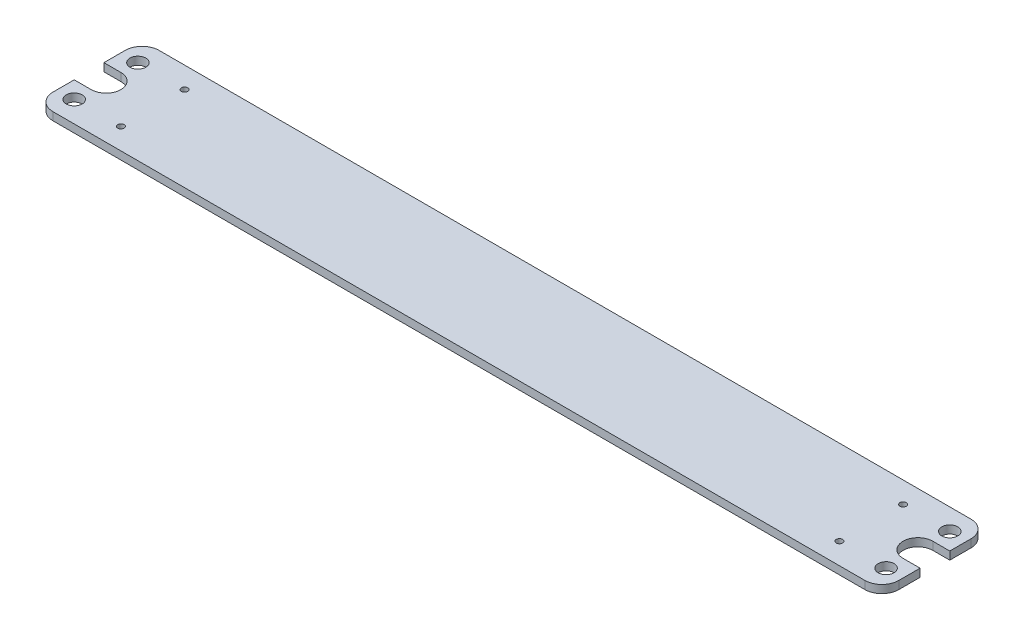
ISO-10303-21;
HEADER;
FILE_DESCRIPTION(('STEP AP214'),'2;1');
FILE_NAME('part.step','',(''),(''),'','','');
FILE_SCHEMA(('AUTOMOTIVE_DESIGN { 1 0 10303 214 1 1 1 1 }'));
ENDSEC;
DATA;
#1=APPLICATION_CONTEXT('core data for automotive mechanical design processes');
#2=APPLICATION_PROTOCOL_DEFINITION('international standard','automotive_design',2000,#1);
#3=PRODUCT_CONTEXT('',#1,'mechanical');
#4=PRODUCT('Part','Part','',(#3));
#5=PRODUCT_RELATED_PRODUCT_CATEGORY('part','',(#4));
#6=PRODUCT_DEFINITION_FORMATION('','',#4);
#7=PRODUCT_DEFINITION_CONTEXT('part definition',#1,'design');
#8=PRODUCT_DEFINITION('design','',#6,#7);
#9=PRODUCT_DEFINITION_SHAPE('','',#8);
#10=(LENGTH_UNIT() NAMED_UNIT(*) SI_UNIT(.MILLI.,.METRE.));
#11=(NAMED_UNIT(*) PLANE_ANGLE_UNIT() SI_UNIT($,.RADIAN.));
#12=(NAMED_UNIT(*) SI_UNIT($,.STERADIAN.) SOLID_ANGLE_UNIT());
#13=UNCERTAINTY_MEASURE_WITH_UNIT(LENGTH_MEASURE(1.E-05),#10,'distance_accuracy_value','');
#14=(GEOMETRIC_REPRESENTATION_CONTEXT(3) GLOBAL_UNCERTAINTY_ASSIGNED_CONTEXT((#13)) GLOBAL_UNIT_ASSIGNED_CONTEXT((#10,
#11,#12)) REPRESENTATION_CONTEXT('',''));
#15=CARTESIAN_POINT('',(0.,0.,0.));
#16=DIRECTION('',(0.,0.,1.));
#17=DIRECTION('',(1.,0.,0.));
#18=AXIS2_PLACEMENT_3D('',#15,#16,#17);
#19=CARTESIAN_POINT('',(10.16,4.7625,31.75));
#20=DIRECTION('',(0.,1.,0.));
#21=DIRECTION('',(0.,0.,1.));
#22=AXIS2_PLACEMENT_3D('',#19,#20,#21);
#23=PLANE('',#22);
#24=CARTESIAN_POINT('',(38.1,4.7625,50.8));
#25=DIRECTION('',(0.,1.,0.));
#26=DIRECTION('',(0.,0.,1.));
#27=AXIS2_PLACEMENT_3D('',#24,#25,#26);
#28=CIRCLE('',#27,1.905);
#29=CARTESIAN_POINT('',(38.1,4.7625,52.705));
#30=VERTEX_POINT('',#29);
#31=EDGE_CURVE('E208',#30,#30,#28,.T.);
#32=ORIENTED_EDGE('',*,*,#31,.F.);
#33=EDGE_LOOP('',(#32));
#34=FACE_BOUND('',#33,.T.);
#35=CARTESIAN_POINT('',(10.16,4.7625,50.8));
#36=DIRECTION('',(0.,1.,0.));
#37=DIRECTION('',(0.,0.,1.));
#38=AXIS2_PLACEMENT_3D('',#35,#36,#37);
#39=CIRCLE('',#38,4.7625);
#40=CARTESIAN_POINT('',(10.16,4.7625,55.5625));
#41=VERTEX_POINT('',#40);
#42=EDGE_CURVE('E139',#41,#41,#39,.T.);
#43=ORIENTED_EDGE('',*,*,#42,.F.);
#44=EDGE_LOOP('',(#43));
#45=FACE_BOUND('',#44,.T.);
#46=CARTESIAN_POINT('',(10.16,4.7625,31.75));
#47=DIRECTION('',(0.,-1.,0.));
#48=DIRECTION('',(0.,0.,1.));
#49=AXIS2_PLACEMENT_3D('',#46,#47,#48);
#50=CIRCLE('',#49,8.89);
#51=CARTESIAN_POINT('',(10.16,4.7625,22.86));
#52=VERTEX_POINT('',#51);
#53=CARTESIAN_POINT('',(10.16,4.7625,40.64));
#54=VERTEX_POINT('',#53);
#55=EDGE_CURVE('E153',#52,#54,#50,.T.);
#56=ORIENTED_EDGE('',*,*,#55,.T.);
#57=DIRECTION('',(-1.,0.,0.));
#58=VECTOR('',#57,1.);
#59=CARTESIAN_POINT('',(10.16,4.7625,40.64));
#60=LINE('',#59,#58);
#61=CARTESIAN_POINT('',(0.,4.7625,40.64));
#62=VERTEX_POINT('',#61);
#63=EDGE_CURVE('E94',#54,#62,#60,.T.);
#64=ORIENTED_EDGE('',*,*,#63,.T.);
#65=DIRECTION('',(0.,0.,1.));
#66=VECTOR('',#65,1.);
#67=CARTESIAN_POINT('',(0.,4.7625,40.64));
#68=LINE('',#67,#66);
#69=CARTESIAN_POINT('',(0.,4.7625,53.34));
#70=VERTEX_POINT('',#69);
#71=EDGE_CURVE('E168',#62,#70,#68,.T.);
#72=ORIENTED_EDGE('',*,*,#71,.T.);
#73=CARTESIAN_POINT('',(10.16,4.7625,53.34));
#74=DIRECTION('',(0.,1.,0.));
#75=DIRECTION('',(0.,0.,1.));
#76=AXIS2_PLACEMENT_3D('',#73,#74,#75);
#77=CIRCLE('',#76,10.16);
#78=CARTESIAN_POINT('',(10.16,4.7625,63.5));
#79=VERTEX_POINT('',#78);
#80=EDGE_CURVE('E192',#70,#79,#77,.T.);
#81=ORIENTED_EDGE('',*,*,#80,.T.);
#82=DIRECTION('',(1.,0.,0.));
#83=VECTOR('',#82,1.);
#84=CARTESIAN_POINT('',(10.16,4.7625,63.5));
#85=LINE('',#84,#83);
#86=CARTESIAN_POINT('',(495.935,4.7625,63.5));
#87=VERTEX_POINT('',#86);
#88=EDGE_CURVE('E187',#79,#87,#85,.T.);
#89=ORIENTED_EDGE('',*,*,#88,.T.);
#90=CARTESIAN_POINT('',(495.935,4.7625,53.34));
#91=DIRECTION('',(0.,-1.,0.));
#92=DIRECTION('',(0.,0.,1.));
#93=AXIS2_PLACEMENT_3D('',#90,#91,#92);
#94=CIRCLE('',#93,10.16);
#95=CARTESIAN_POINT('',(506.095,4.7625,53.34));
#96=VERTEX_POINT('',#95);
#97=EDGE_CURVE('E272',#96,#87,#94,.T.);
#98=ORIENTED_EDGE('',*,*,#97,.F.);
#99=DIRECTION('',(0.,0.,1.));
#100=VECTOR('',#99,1.);
#101=CARTESIAN_POINT('',(506.095,4.7625,40.64));
#102=LINE('',#101,#100);
#103=CARTESIAN_POINT('',(506.095,4.7625,40.64));
#104=VERTEX_POINT('',#103);
#105=EDGE_CURVE('E269',#104,#96,#102,.T.);
#106=ORIENTED_EDGE('',*,*,#105,.F.);
#107=DIRECTION('',(1.,0.,0.));
#108=VECTOR('',#107,1.);
#109=CARTESIAN_POINT('',(495.935,4.7625,40.64));
#110=LINE('',#109,#108);
#111=CARTESIAN_POINT('',(495.935,4.7625,40.64));
#112=VERTEX_POINT('',#111);
#113=EDGE_CURVE('E244',#112,#104,#110,.T.);
#114=ORIENTED_EDGE('',*,*,#113,.F.);
#115=CARTESIAN_POINT('',(495.935,4.7625,31.75));
#116=DIRECTION('',(0.,1.,0.));
#117=DIRECTION('',(0.,0.,1.));
#118=AXIS2_PLACEMENT_3D('',#115,#116,#117);
#119=CIRCLE('',#118,8.89);
#120=CARTESIAN_POINT('',(495.935,4.7625,22.86));
#121=VERTEX_POINT('',#120);
#122=EDGE_CURVE('E248',#121,#112,#119,.T.);
#123=ORIENTED_EDGE('',*,*,#122,.F.);
#124=DIRECTION('',(-1.,0.,0.));
#125=VECTOR('',#124,1.);
#126=CARTESIAN_POINT('',(495.935,4.7625,22.86));
#127=LINE('',#126,#125);
#128=CARTESIAN_POINT('',(506.095,4.7625,22.86));
#129=VERTEX_POINT('',#128);
#130=EDGE_CURVE('E280',#129,#121,#127,.T.);
#131=ORIENTED_EDGE('',*,*,#130,.F.);
#132=DIRECTION('',(0.,0.,1.));
#133=VECTOR('',#132,1.);
#134=CARTESIAN_POINT('',(506.095,4.7625,10.16));
#135=LINE('',#134,#133);
#136=CARTESIAN_POINT('',(506.095,4.7625,10.16));
#137=VERTEX_POINT('',#136);
#138=EDGE_CURVE('E277',#137,#129,#135,.T.);
#139=ORIENTED_EDGE('',*,*,#138,.F.);
#140=CARTESIAN_POINT('',(495.935,4.7625,10.16));
#141=DIRECTION('',(0.,-1.,0.));
#142=DIRECTION('',(0.,0.,1.));
#143=AXIS2_PLACEMENT_3D('',#140,#141,#142);
#144=CIRCLE('',#143,10.16);
#145=CARTESIAN_POINT('',(495.935,4.7625,0.));
#146=VERTEX_POINT('',#145);
#147=EDGE_CURVE('E274',#146,#137,#144,.T.);
#148=ORIENTED_EDGE('',*,*,#147,.F.);
#149=DIRECTION('',(-1.,0.,0.));
#150=VECTOR('',#149,1.);
#151=CARTESIAN_POINT('',(10.16,4.7625,0.));
#152=LINE('',#151,#150);
#153=CARTESIAN_POINT('',(10.16,4.7625,0.));
#154=VERTEX_POINT('',#153);
#155=EDGE_CURVE('E117',#146,#154,#152,.T.);
#156=ORIENTED_EDGE('',*,*,#155,.T.);
#157=CARTESIAN_POINT('',(10.16,4.7625,10.16));
#158=DIRECTION('',(0.,1.,0.));
#159=DIRECTION('',(0.,0.,1.));
#160=AXIS2_PLACEMENT_3D('',#157,#158,#159);
#161=CIRCLE('',#160,10.16);
#162=CARTESIAN_POINT('',(0.,4.7625,10.16));
#163=VERTEX_POINT('',#162);
#164=EDGE_CURVE('E110',#154,#163,#161,.T.);
#165=ORIENTED_EDGE('',*,*,#164,.T.);
#166=DIRECTION('',(0.,0.,1.));
#167=VECTOR('',#166,1.);
#168=CARTESIAN_POINT('',(0.,4.7625,10.16));
#169=LINE('',#168,#167);
#170=CARTESIAN_POINT('',(0.,4.7625,22.86));
#171=VERTEX_POINT('',#170);
#172=EDGE_CURVE('E114',#163,#171,#169,.T.);
#173=ORIENTED_EDGE('',*,*,#172,.T.);
#174=DIRECTION('',(1.,0.,0.));
#175=VECTOR('',#174,1.);
#176=CARTESIAN_POINT('',(10.16,4.7625,22.86));
#177=LINE('',#176,#175);
#178=EDGE_CURVE('E50',#171,#52,#177,.T.);
#179=ORIENTED_EDGE('',*,*,#178,.T.);
#180=EDGE_LOOP('',(#56,#64,#72,#81,#89,#98,#106,#114,#123,#131,#139,#148,#156,#165,#173,#179));
#181=FACE_BOUND('',#180,.T.);
#182=CARTESIAN_POINT('',(10.16,4.7625,12.7));
#183=DIRECTION('',(0.,1.,0.));
#184=DIRECTION('',(0.,0.,1.));
#185=AXIS2_PLACEMENT_3D('',#182,#183,#184);
#186=CIRCLE('',#185,4.76250000000001);
#187=CARTESIAN_POINT('',(10.16,4.7625,17.4625));
#188=VERTEX_POINT('',#187);
#189=EDGE_CURVE('E202',#188,#188,#186,.T.);
#190=ORIENTED_EDGE('',*,*,#189,.F.);
#191=EDGE_LOOP('',(#190));
#192=FACE_BOUND('',#191,.T.);
#193=CARTESIAN_POINT('',(38.1,4.7625,12.7));
#194=DIRECTION('',(0.,1.,0.));
#195=DIRECTION('',(0.,0.,1.));
#196=AXIS2_PLACEMENT_3D('',#193,#194,#195);
#197=CIRCLE('',#196,1.905);
#198=CARTESIAN_POINT('',(38.1,4.7625,14.605));
#199=VERTEX_POINT('',#198);
#200=EDGE_CURVE('E214',#199,#199,#197,.T.);
#201=ORIENTED_EDGE('',*,*,#200,.F.);
#202=EDGE_LOOP('',(#201));
#203=FACE_BOUND('',#202,.T.);
#204=CARTESIAN_POINT('',(467.995,4.7625,12.7));
#205=DIRECTION('',(0.,-1.,0.));
#206=DIRECTION('',(0.,0.,1.));
#207=AXIS2_PLACEMENT_3D('',#204,#205,#206);
#208=CIRCLE('',#207,1.905);
#209=CARTESIAN_POINT('',(467.995,4.7625,14.605));
#210=VERTEX_POINT('',#209);
#211=EDGE_CURVE('E300',#210,#210,#208,.T.);
#212=ORIENTED_EDGE('',*,*,#211,.T.);
#213=EDGE_LOOP('',(#212));
#214=FACE_BOUND('',#213,.T.);
#215=CARTESIAN_POINT('',(467.995,4.7625,50.8));
#216=DIRECTION('',(0.,-1.,0.));
#217=DIRECTION('',(0.,0.,1.));
#218=AXIS2_PLACEMENT_3D('',#215,#216,#217);
#219=CIRCLE('',#218,1.905);
#220=CARTESIAN_POINT('',(467.995,4.7625,52.705));
#221=VERTEX_POINT('',#220);
#222=EDGE_CURVE('E294',#221,#221,#219,.T.);
#223=ORIENTED_EDGE('',*,*,#222,.T.);
#224=EDGE_LOOP('',(#223));
#225=FACE_BOUND('',#224,.T.);
#226=CARTESIAN_POINT('',(495.935,4.7625,12.7));
#227=DIRECTION('',(0.,-1.,0.));
#228=DIRECTION('',(0.,0.,1.));
#229=AXIS2_PLACEMENT_3D('',#226,#227,#228);
#230=CIRCLE('',#229,4.76250000000001);
#231=CARTESIAN_POINT('',(495.935,4.7625,17.4625));
#232=VERTEX_POINT('',#231);
#233=EDGE_CURVE('E288',#232,#232,#230,.T.);
#234=ORIENTED_EDGE('',*,*,#233,.T.);
#235=EDGE_LOOP('',(#234));
#236=FACE_BOUND('',#235,.T.);
#237=CARTESIAN_POINT('',(495.935,4.7625,50.8));
#238=DIRECTION('',(0.,-1.,0.));
#239=DIRECTION('',(0.,0.,1.));
#240=AXIS2_PLACEMENT_3D('',#237,#238,#239);
#241=CIRCLE('',#240,4.7625);
#242=CARTESIAN_POINT('',(495.935,4.7625,55.5625));
#243=VERTEX_POINT('',#242);
#244=EDGE_CURVE('E266',#243,#243,#241,.T.);
#245=ORIENTED_EDGE('',*,*,#244,.T.);
#246=EDGE_LOOP('',(#245));
#247=FACE_BOUND('',#246,.T.);
#248=ADVANCED_FACE('F33',(#34,#45,#181,#192,#203,#214,#225,#236,#247),#23,.T.);
#249=CARTESIAN_POINT('',(10.16,0.,31.75));
#250=DIRECTION('',(0.,1.,0.));
#251=DIRECTION('',(0.,0.,1.));
#252=AXIS2_PLACEMENT_3D('',#249,#250,#251);
#253=PLANE('',#252);
#254=CARTESIAN_POINT('',(10.16,0.,31.75));
#255=DIRECTION('',(0.,-1.,0.));
#256=DIRECTION('',(0.,0.,1.));
#257=AXIS2_PLACEMENT_3D('',#254,#255,#256);
#258=CIRCLE('',#257,8.89);
#259=CARTESIAN_POINT('',(10.16,0.,22.86));
#260=VERTEX_POINT('',#259);
#261=CARTESIAN_POINT('',(10.16,0.,40.64));
#262=VERTEX_POINT('',#261);
#263=EDGE_CURVE('E135',#260,#262,#258,.T.);
#264=ORIENTED_EDGE('',*,*,#263,.F.);
#265=DIRECTION('',(1.,0.,0.));
#266=VECTOR('',#265,1.);
#267=CARTESIAN_POINT('',(10.16,0.,22.86));
#268=LINE('',#267,#266);
#269=CARTESIAN_POINT('',(0.,0.,22.86));
#270=VERTEX_POINT('',#269);
#271=EDGE_CURVE('E86',#270,#260,#268,.T.);
#272=ORIENTED_EDGE('',*,*,#271,.F.);
#273=DIRECTION('',(0.,0.,1.));
#274=VECTOR('',#273,1.);
#275=CARTESIAN_POINT('',(0.,0.,10.16));
#276=LINE('',#275,#274);
#277=CARTESIAN_POINT('',(0.,0.,10.16));
#278=VERTEX_POINT('',#277);
#279=EDGE_CURVE('E80',#278,#270,#276,.T.);
#280=ORIENTED_EDGE('',*,*,#279,.F.);
#281=CARTESIAN_POINT('',(10.16,0.,10.16));
#282=DIRECTION('',(0.,1.,0.));
#283=DIRECTION('',(0.,0.,1.));
#284=AXIS2_PLACEMENT_3D('',#281,#282,#283);
#285=CIRCLE('',#284,10.16);
#286=CARTESIAN_POINT('',(10.16,0.,0.));
#287=VERTEX_POINT('',#286);
#288=EDGE_CURVE('E125',#287,#278,#285,.T.);
#289=ORIENTED_EDGE('',*,*,#288,.F.);
#290=DIRECTION('',(-1.,0.,0.));
#291=VECTOR('',#290,1.);
#292=CARTESIAN_POINT('',(10.16,0.,0.));
#293=LINE('',#292,#291);
#294=CARTESIAN_POINT('',(495.935,0.,0.));
#295=VERTEX_POINT('',#294);
#296=EDGE_CURVE('E148',#295,#287,#293,.T.);
#297=ORIENTED_EDGE('',*,*,#296,.F.);
#298=CARTESIAN_POINT('',(495.935,0.,10.16));
#299=DIRECTION('',(0.,-1.,0.));
#300=DIRECTION('',(0.,0.,1.));
#301=AXIS2_PLACEMENT_3D('',#298,#299,#300);
#302=CIRCLE('',#301,10.16);
#303=CARTESIAN_POINT('',(506.095,0.,10.16));
#304=VERTEX_POINT('',#303);
#305=EDGE_CURVE('E254',#295,#304,#302,.T.);
#306=ORIENTED_EDGE('',*,*,#305,.T.);
#307=DIRECTION('',(0.,0.,1.));
#308=VECTOR('',#307,1.);
#309=CARTESIAN_POINT('',(506.095,0.,10.16));
#310=LINE('',#309,#308);
#311=CARTESIAN_POINT('',(506.095,0.,22.86));
#312=VERTEX_POINT('',#311);
#313=EDGE_CURVE('E257',#304,#312,#310,.T.);
#314=ORIENTED_EDGE('',*,*,#313,.T.);
#315=DIRECTION('',(-1.,0.,0.));
#316=VECTOR('',#315,1.);
#317=CARTESIAN_POINT('',(495.935,0.,22.86));
#318=LINE('',#317,#316);
#319=CARTESIAN_POINT('',(495.935,0.,22.86));
#320=VERTEX_POINT('',#319);
#321=EDGE_CURVE('E260',#312,#320,#318,.T.);
#322=ORIENTED_EDGE('',*,*,#321,.T.);
#323=CARTESIAN_POINT('',(495.935,0.,31.75));
#324=DIRECTION('',(0.,1.,0.));
#325=DIRECTION('',(0.,0.,1.));
#326=AXIS2_PLACEMENT_3D('',#323,#324,#325);
#327=CIRCLE('',#326,8.89);
#328=CARTESIAN_POINT('',(495.935,0.,40.64));
#329=VERTEX_POINT('',#328);
#330=EDGE_CURVE('E263',#320,#329,#327,.T.);
#331=ORIENTED_EDGE('',*,*,#330,.T.);
#332=DIRECTION('',(1.,0.,0.));
#333=VECTOR('',#332,1.);
#334=CARTESIAN_POINT('',(495.935,0.,40.64));
#335=LINE('',#334,#333);
#336=CARTESIAN_POINT('',(506.095,0.,40.64));
#337=VERTEX_POINT('',#336);
#338=EDGE_CURVE('E245',#329,#337,#335,.T.);
#339=ORIENTED_EDGE('',*,*,#338,.T.);
#340=DIRECTION('',(0.,0.,1.));
#341=VECTOR('',#340,1.);
#342=CARTESIAN_POINT('',(506.095,0.,40.64));
#343=LINE('',#342,#341);
#344=CARTESIAN_POINT('',(506.095,0.,53.34));
#345=VERTEX_POINT('',#344);
#346=EDGE_CURVE('E249',#337,#345,#343,.T.);
#347=ORIENTED_EDGE('',*,*,#346,.T.);
#348=CARTESIAN_POINT('',(495.935,0.,53.34));
#349=DIRECTION('',(0.,-1.,0.));
#350=DIRECTION('',(0.,0.,1.));
#351=AXIS2_PLACEMENT_3D('',#348,#349,#350);
#352=CIRCLE('',#351,10.16);
#353=CARTESIAN_POINT('',(495.935,0.,63.5));
#354=VERTEX_POINT('',#353);
#355=EDGE_CURVE('E252',#345,#354,#352,.T.);
#356=ORIENTED_EDGE('',*,*,#355,.T.);
#357=DIRECTION('',(1.,0.,0.));
#358=VECTOR('',#357,1.);
#359=CARTESIAN_POINT('',(10.16,0.,63.5));
#360=LINE('',#359,#358);
#361=CARTESIAN_POINT('',(10.16,0.,63.5));
#362=VERTEX_POINT('',#361);
#363=EDGE_CURVE('E145',#362,#354,#360,.T.);
#364=ORIENTED_EDGE('',*,*,#363,.F.);
#365=CARTESIAN_POINT('',(10.16,0.,53.34));
#366=DIRECTION('',(0.,1.,0.));
#367=DIRECTION('',(0.,0.,1.));
#368=AXIS2_PLACEMENT_3D('',#365,#366,#367);
#369=CIRCLE('',#368,10.16);
#370=CARTESIAN_POINT('',(0.,0.,53.34));
#371=VERTEX_POINT('',#370);
#372=EDGE_CURVE('E143',#371,#362,#369,.T.);
#373=ORIENTED_EDGE('',*,*,#372,.F.);
#374=DIRECTION('',(0.,0.,1.));
#375=VECTOR('',#374,1.);
#376=CARTESIAN_POINT('',(0.,0.,40.64));
#377=LINE('',#376,#375);
#378=CARTESIAN_POINT('',(0.,0.,40.64));
#379=VERTEX_POINT('',#378);
#380=EDGE_CURVE('E141',#379,#371,#377,.T.);
#381=ORIENTED_EDGE('',*,*,#380,.F.);
#382=DIRECTION('',(-1.,0.,0.));
#383=VECTOR('',#382,1.);
#384=CARTESIAN_POINT('',(10.16,0.,40.64));
#385=LINE('',#384,#383);
#386=EDGE_CURVE('E138',#262,#379,#385,.T.);
#387=ORIENTED_EDGE('',*,*,#386,.F.);
#388=EDGE_LOOP('',(#264,#272,#280,#289,#297,#306,#314,#322,#331,#339,#347,#356,#364,#373,#381,#387));
#389=FACE_BOUND('',#388,.T.);
#390=CARTESIAN_POINT('',(10.16,0.,50.8));
#391=DIRECTION('',(0.,1.,0.));
#392=DIRECTION('',(0.,0.,1.));
#393=AXIS2_PLACEMENT_3D('',#390,#391,#392);
#394=CIRCLE('',#393,4.7625);
#395=CARTESIAN_POINT('',(10.16,0.,55.5625));
#396=VERTEX_POINT('',#395);
#397=EDGE_CURVE('E199',#396,#396,#394,.T.);
#398=ORIENTED_EDGE('',*,*,#397,.T.);
#399=EDGE_LOOP('',(#398));
#400=FACE_BOUND('',#399,.T.);
#401=CARTESIAN_POINT('',(10.16,0.,12.7));
#402=DIRECTION('',(0.,1.,0.));
#403=DIRECTION('',(0.,0.,1.));
#404=AXIS2_PLACEMENT_3D('',#401,#402,#403);
#405=CIRCLE('',#404,4.76250000000001);
#406=CARTESIAN_POINT('',(10.16,0.,17.4625));
#407=VERTEX_POINT('',#406);
#408=EDGE_CURVE('E205',#407,#407,#405,.T.);
#409=ORIENTED_EDGE('',*,*,#408,.T.);
#410=EDGE_LOOP('',(#409));
#411=FACE_BOUND('',#410,.T.);
#412=CARTESIAN_POINT('',(38.1,0.,50.8));
#413=DIRECTION('',(0.,1.,0.));
#414=DIRECTION('',(0.,0.,1.));
#415=AXIS2_PLACEMENT_3D('',#412,#413,#414);
#416=CIRCLE('',#415,1.905);
#417=CARTESIAN_POINT('',(38.1,0.,52.705));
#418=VERTEX_POINT('',#417);
#419=EDGE_CURVE('E211',#418,#418,#416,.T.);
#420=ORIENTED_EDGE('',*,*,#419,.T.);
#421=EDGE_LOOP('',(#420));
#422=FACE_BOUND('',#421,.T.);
#423=CARTESIAN_POINT('',(38.1,0.,12.7));
#424=DIRECTION('',(0.,1.,0.));
#425=DIRECTION('',(0.,0.,1.));
#426=AXIS2_PLACEMENT_3D('',#423,#424,#425);
#427=CIRCLE('',#426,1.905);
#428=CARTESIAN_POINT('',(38.1,0.,14.605));
#429=VERTEX_POINT('',#428);
#430=EDGE_CURVE('E217',#429,#429,#427,.T.);
#431=ORIENTED_EDGE('',*,*,#430,.T.);
#432=EDGE_LOOP('',(#431));
#433=FACE_BOUND('',#432,.T.);
#434=CARTESIAN_POINT('',(467.995,0.,12.7));
#435=DIRECTION('',(0.,-1.,0.));
#436=DIRECTION('',(0.,0.,1.));
#437=AXIS2_PLACEMENT_3D('',#434,#435,#436);
#438=CIRCLE('',#437,1.905);
#439=CARTESIAN_POINT('',(467.995,0.,14.605));
#440=VERTEX_POINT('',#439);
#441=EDGE_CURVE('E303',#440,#440,#438,.T.);
#442=ORIENTED_EDGE('',*,*,#441,.F.);
#443=EDGE_LOOP('',(#442));
#444=FACE_BOUND('',#443,.T.);
#445=CARTESIAN_POINT('',(467.995,0.,50.8));
#446=DIRECTION('',(0.,-1.,0.));
#447=DIRECTION('',(0.,0.,1.));
#448=AXIS2_PLACEMENT_3D('',#445,#446,#447);
#449=CIRCLE('',#448,1.905);
#450=CARTESIAN_POINT('',(467.995,0.,52.705));
#451=VERTEX_POINT('',#450);
#452=EDGE_CURVE('E297',#451,#451,#449,.T.);
#453=ORIENTED_EDGE('',*,*,#452,.F.);
#454=EDGE_LOOP('',(#453));
#455=FACE_BOUND('',#454,.T.);
#456=CARTESIAN_POINT('',(495.935,0.,12.7));
#457=DIRECTION('',(0.,-1.,0.));
#458=DIRECTION('',(0.,0.,1.));
#459=AXIS2_PLACEMENT_3D('',#456,#457,#458);
#460=CIRCLE('',#459,4.76250000000001);
#461=CARTESIAN_POINT('',(495.935,0.,17.4625));
#462=VERTEX_POINT('',#461);
#463=EDGE_CURVE('E291',#462,#462,#460,.T.);
#464=ORIENTED_EDGE('',*,*,#463,.F.);
#465=EDGE_LOOP('',(#464));
#466=FACE_BOUND('',#465,.T.);
#467=CARTESIAN_POINT('',(495.935,0.,50.8));
#468=DIRECTION('',(0.,-1.,0.));
#469=DIRECTION('',(0.,0.,1.));
#470=AXIS2_PLACEMENT_3D('',#467,#468,#469);
#471=CIRCLE('',#470,4.7625);
#472=CARTESIAN_POINT('',(495.935,0.,55.5625));
#473=VERTEX_POINT('',#472);
#474=EDGE_CURVE('E285',#473,#473,#471,.T.);
#475=ORIENTED_EDGE('',*,*,#474,.F.);
#476=EDGE_LOOP('',(#475));
#477=FACE_BOUND('',#476,.T.);
#478=ADVANCED_FACE('F172',(#389,#400,#411,#422,#433,#444,#455,#466,#477),#253,.F.);
#479=CARTESIAN_POINT('',(10.16,4.7625,31.75));
#480=DIRECTION('',(0.,-1.,0.));
#481=DIRECTION('',(0.,0.,-1.));
#482=AXIS2_PLACEMENT_3D('',#479,#480,#481);
#483=CYLINDRICAL_SURFACE('',#482,8.89);
#484=ORIENTED_EDGE('',*,*,#263,.T.);
#485=DIRECTION('',(0.,-1.,0.));
#486=VECTOR('',#485,1.);
#487=CARTESIAN_POINT('',(10.16,4.7625,40.64));
#488=LINE('',#487,#486);
#489=EDGE_CURVE('E11',#54,#262,#488,.T.);
#490=ORIENTED_EDGE('',*,*,#489,.F.);
#491=ORIENTED_EDGE('',*,*,#55,.F.);
#492=DIRECTION('',(0.,-1.,0.));
#493=VECTOR('',#492,1.);
#494=CARTESIAN_POINT('',(10.16,4.7625,22.86));
#495=LINE('',#494,#493);
#496=EDGE_CURVE('E131',#52,#260,#495,.T.);
#497=ORIENTED_EDGE('',*,*,#496,.T.);
#498=EDGE_LOOP('',(#484,#490,#491,#497));
#499=FACE_BOUND('',#498,.T.);
#500=ADVANCED_FACE('F35',(#499),#483,.F.);
#501=CARTESIAN_POINT('',(10.16,4.7625,40.64));
#502=DIRECTION('',(0.,0.,1.));
#503=DIRECTION('',(1.,0.,0.));
#504=AXIS2_PLACEMENT_3D('',#501,#502,#503);
#505=PLANE('',#504);
#506=ORIENTED_EDGE('',*,*,#386,.T.);
#507=DIRECTION('',(0.,-1.,0.));
#508=VECTOR('',#507,1.);
#509=CARTESIAN_POINT('',(0.,4.7625,40.64));
#510=LINE('',#509,#508);
#511=EDGE_CURVE('E42',#62,#379,#510,.T.);
#512=ORIENTED_EDGE('',*,*,#511,.F.);
#513=ORIENTED_EDGE('',*,*,#63,.F.);
#514=ORIENTED_EDGE('',*,*,#489,.T.);
#515=EDGE_LOOP('',(#506,#512,#513,#514));
#516=FACE_BOUND('',#515,.T.);
#517=ADVANCED_FACE('F370',(#516),#505,.F.);
#518=CARTESIAN_POINT('',(0.,4.7625,40.64));
#519=DIRECTION('',(1.,0.,0.));
#520=DIRECTION('',(0.,0.,-1.));
#521=AXIS2_PLACEMENT_3D('',#518,#519,#520);
#522=PLANE('',#521);
#523=ORIENTED_EDGE('',*,*,#380,.T.);
#524=DIRECTION('',(0.,-1.,0.));
#525=VECTOR('',#524,1.);
#526=CARTESIAN_POINT('',(0.,4.7625,53.34));
#527=LINE('',#526,#525);
#528=EDGE_CURVE('E160',#70,#371,#527,.T.);
#529=ORIENTED_EDGE('',*,*,#528,.F.);
#530=ORIENTED_EDGE('',*,*,#71,.F.);
#531=ORIENTED_EDGE('',*,*,#511,.T.);
#532=EDGE_LOOP('',(#523,#529,#530,#531));
#533=FACE_BOUND('',#532,.T.);
#534=ADVANCED_FACE('F166',(#533),#522,.F.);
#535=CARTESIAN_POINT('',(10.16,4.7625,53.34));
#536=DIRECTION('',(0.,-1.,0.));
#537=DIRECTION('',(0.,0.,-1.));
#538=AXIS2_PLACEMENT_3D('',#535,#536,#537);
#539=CYLINDRICAL_SURFACE('',#538,10.16);
#540=ORIENTED_EDGE('',*,*,#372,.T.);
#541=DIRECTION('',(0.,-1.,0.));
#542=VECTOR('',#541,1.);
#543=CARTESIAN_POINT('',(10.16,4.7625,63.5));
#544=LINE('',#543,#542);
#545=EDGE_CURVE('E157',#79,#362,#544,.T.);
#546=ORIENTED_EDGE('',*,*,#545,.F.);
#547=ORIENTED_EDGE('',*,*,#80,.F.);
#548=ORIENTED_EDGE('',*,*,#528,.T.);
#549=EDGE_LOOP('',(#540,#546,#547,#548));
#550=FACE_BOUND('',#549,.T.);
#551=ADVANCED_FACE('F178',(#550),#539,.T.);
#552=CARTESIAN_POINT('',(10.16,4.7625,63.5));
#553=DIRECTION('',(0.,0.,-1.));
#554=DIRECTION('',(-1.,0.,0.));
#555=AXIS2_PLACEMENT_3D('',#552,#553,#554);
#556=PLANE('',#555);
#557=ORIENTED_EDGE('',*,*,#363,.T.);
#558=DIRECTION('',(0.,-1.,0.));
#559=VECTOR('',#558,1.);
#560=CARTESIAN_POINT('',(495.935,4.7625,63.5));
#561=LINE('',#560,#559);
#562=EDGE_CURVE('E189',#87,#354,#561,.T.);
#563=ORIENTED_EDGE('',*,*,#562,.F.);
#564=ORIENTED_EDGE('',*,*,#88,.F.);
#565=ORIENTED_EDGE('',*,*,#545,.T.);
#566=EDGE_LOOP('',(#557,#563,#564,#565));
#567=FACE_BOUND('',#566,.T.);
#568=ADVANCED_FACE('F182',(#567),#556,.F.);
#569=CARTESIAN_POINT('',(10.16,4.7625,0.));
#570=DIRECTION('',(0.,0.,1.));
#571=DIRECTION('',(1.,0.,0.));
#572=AXIS2_PLACEMENT_3D('',#569,#570,#571);
#573=PLANE('',#572);
#574=ORIENTED_EDGE('',*,*,#296,.T.);
#575=DIRECTION('',(0.,-1.,0.));
#576=VECTOR('',#575,1.);
#577=CARTESIAN_POINT('',(10.16,4.7625,0.));
#578=LINE('',#577,#576);
#579=EDGE_CURVE('E126',#154,#287,#578,.T.);
#580=ORIENTED_EDGE('',*,*,#579,.F.);
#581=ORIENTED_EDGE('',*,*,#155,.F.);
#582=DIRECTION('',(0.,-1.,0.));
#583=VECTOR('',#582,1.);
#584=CARTESIAN_POINT('',(495.935,4.7625,0.));
#585=LINE('',#584,#583);
#586=EDGE_CURVE('E231',#146,#295,#585,.T.);
#587=ORIENTED_EDGE('',*,*,#586,.T.);
#588=EDGE_LOOP('',(#574,#580,#581,#587));
#589=FACE_BOUND('',#588,.T.);
#590=ADVANCED_FACE('F361',(#589),#573,.F.);
#591=CARTESIAN_POINT('',(10.16,4.7625,10.16));
#592=DIRECTION('',(0.,-1.,0.));
#593=DIRECTION('',(0.,0.,-1.));
#594=AXIS2_PLACEMENT_3D('',#591,#592,#593);
#595=CYLINDRICAL_SURFACE('',#594,10.16);
#596=ORIENTED_EDGE('',*,*,#288,.T.);
#597=DIRECTION('',(0.,-1.,0.));
#598=VECTOR('',#597,1.);
#599=CARTESIAN_POINT('',(0.,4.7625,10.16));
#600=LINE('',#599,#598);
#601=EDGE_CURVE('E122',#163,#278,#600,.T.);
#602=ORIENTED_EDGE('',*,*,#601,.F.);
#603=ORIENTED_EDGE('',*,*,#164,.F.);
#604=ORIENTED_EDGE('',*,*,#579,.T.);
#605=EDGE_LOOP('',(#596,#602,#603,#604));
#606=FACE_BOUND('',#605,.T.);
#607=ADVANCED_FACE('F123',(#606),#595,.T.);
#608=CARTESIAN_POINT('',(0.,4.7625,10.16));
#609=DIRECTION('',(1.,0.,0.));
#610=DIRECTION('',(0.,0.,-1.));
#611=AXIS2_PLACEMENT_3D('',#608,#609,#610);
#612=PLANE('',#611);
#613=ORIENTED_EDGE('',*,*,#279,.T.);
#614=DIRECTION('',(0.,-1.,0.));
#615=VECTOR('',#614,1.);
#616=CARTESIAN_POINT('',(0.,4.7625,22.86));
#617=LINE('',#616,#615);
#618=EDGE_CURVE('E127',#171,#270,#617,.T.);
#619=ORIENTED_EDGE('',*,*,#618,.F.);
#620=ORIENTED_EDGE('',*,*,#172,.F.);
#621=ORIENTED_EDGE('',*,*,#601,.T.);
#622=EDGE_LOOP('',(#613,#619,#620,#621));
#623=FACE_BOUND('',#622,.T.);
#624=ADVANCED_FACE('F129',(#623),#612,.F.);
#625=CARTESIAN_POINT('',(10.16,4.7625,22.86));
#626=DIRECTION('',(0.,0.,-1.));
#627=DIRECTION('',(-1.,0.,0.));
#628=AXIS2_PLACEMENT_3D('',#625,#626,#627);
#629=PLANE('',#628);
#630=ORIENTED_EDGE('',*,*,#271,.T.);
#631=ORIENTED_EDGE('',*,*,#496,.F.);
#632=ORIENTED_EDGE('',*,*,#178,.F.);
#633=ORIENTED_EDGE('',*,*,#618,.T.);
#634=EDGE_LOOP('',(#630,#631,#632,#633));
#635=FACE_BOUND('',#634,.T.);
#636=ADVANCED_FACE('F354',(#635),#629,.F.);
#637=CARTESIAN_POINT('',(10.16,4.7625,50.8));
#638=DIRECTION('',(0.,-1.,0.));
#639=DIRECTION('',(0.,0.,-1.));
#640=AXIS2_PLACEMENT_3D('',#637,#638,#639);
#641=CYLINDRICAL_SURFACE('',#640,4.7625);
#642=ORIENTED_EDGE('',*,*,#42,.T.);
#643=EDGE_LOOP('',(#642));
#644=FACE_BOUND('',#643,.T.);
#645=ORIENTED_EDGE('',*,*,#397,.F.);
#646=EDGE_LOOP('',(#645));
#647=FACE_BOUND('',#646,.T.);
#648=ADVANCED_FACE('F351',(#644,#647),#641,.F.);
#649=CARTESIAN_POINT('',(10.16,4.7625,12.7));
#650=DIRECTION('',(0.,-1.,0.));
#651=DIRECTION('',(0.,0.,-1.));
#652=AXIS2_PLACEMENT_3D('',#649,#650,#651);
#653=CYLINDRICAL_SURFACE('',#652,4.76250000000001);
#654=ORIENTED_EDGE('',*,*,#189,.T.);
#655=EDGE_LOOP('',(#654));
#656=FACE_BOUND('',#655,.T.);
#657=ORIENTED_EDGE('',*,*,#408,.F.);
#658=EDGE_LOOP('',(#657));
#659=FACE_BOUND('',#658,.T.);
#660=ADVANCED_FACE('F456',(#656,#659),#653,.F.);
#661=CARTESIAN_POINT('',(38.1,4.7625,50.8));
#662=DIRECTION('',(0.,-1.,0.));
#663=DIRECTION('',(0.,0.,-1.));
#664=AXIS2_PLACEMENT_3D('',#661,#662,#663);
#665=CYLINDRICAL_SURFACE('',#664,1.905);
#666=ORIENTED_EDGE('',*,*,#31,.T.);
#667=EDGE_LOOP('',(#666));
#668=FACE_BOUND('',#667,.T.);
#669=ORIENTED_EDGE('',*,*,#419,.F.);
#670=EDGE_LOOP('',(#669));
#671=FACE_BOUND('',#670,.T.);
#672=ADVANCED_FACE('F453',(#668,#671),#665,.F.);
#673=CARTESIAN_POINT('',(38.1,4.7625,12.7));
#674=DIRECTION('',(0.,-1.,0.));
#675=DIRECTION('',(0.,0.,-1.));
#676=AXIS2_PLACEMENT_3D('',#673,#674,#675);
#677=CYLINDRICAL_SURFACE('',#676,1.905);
#678=ORIENTED_EDGE('',*,*,#200,.T.);
#679=EDGE_LOOP('',(#678));
#680=FACE_BOUND('',#679,.T.);
#681=ORIENTED_EDGE('',*,*,#430,.F.);
#682=EDGE_LOOP('',(#681));
#683=FACE_BOUND('',#682,.T.);
#684=ADVANCED_FACE('F450',(#680,#683),#677,.F.);
#685=CARTESIAN_POINT('',(495.935,4.7625,31.75));
#686=DIRECTION('',(0.,-1.,0.));
#687=DIRECTION('',(0.,0.,-1.));
#688=AXIS2_PLACEMENT_3D('',#685,#686,#687);
#689=CYLINDRICAL_SURFACE('',#688,8.89);
#690=ORIENTED_EDGE('',*,*,#330,.F.);
#691=DIRECTION('',(0.,-1.,0.));
#692=VECTOR('',#691,1.);
#693=CARTESIAN_POINT('',(495.935,4.7625,22.86));
#694=LINE('',#693,#692);
#695=EDGE_CURVE('E220',#121,#320,#694,.T.);
#696=ORIENTED_EDGE('',*,*,#695,.F.);
#697=ORIENTED_EDGE('',*,*,#122,.T.);
#698=DIRECTION('',(0.,-1.,0.));
#699=VECTOR('',#698,1.);
#700=CARTESIAN_POINT('',(495.935,4.7625,40.64));
#701=LINE('',#700,#699);
#702=EDGE_CURVE('E241',#112,#329,#701,.T.);
#703=ORIENTED_EDGE('',*,*,#702,.T.);
#704=EDGE_LOOP('',(#690,#696,#697,#703));
#705=FACE_BOUND('',#704,.T.);
#706=ADVANCED_FACE('F426',(#705),#689,.F.);
#707=CARTESIAN_POINT('',(495.935,4.7625,22.86));
#708=DIRECTION('',(0.,0.,1.));
#709=DIRECTION('',(1.,0.,0.));
#710=AXIS2_PLACEMENT_3D('',#707,#708,#709);
#711=PLANE('',#710);
#712=ORIENTED_EDGE('',*,*,#321,.F.);
#713=DIRECTION('',(0.,-1.,0.));
#714=VECTOR('',#713,1.);
#715=CARTESIAN_POINT('',(506.095,4.7625,22.86));
#716=LINE('',#715,#714);
#717=EDGE_CURVE('E225',#129,#312,#716,.T.);
#718=ORIENTED_EDGE('',*,*,#717,.F.);
#719=ORIENTED_EDGE('',*,*,#130,.T.);
#720=ORIENTED_EDGE('',*,*,#695,.T.);
#721=EDGE_LOOP('',(#712,#718,#719,#720));
#722=FACE_BOUND('',#721,.T.);
#723=ADVANCED_FACE('F444',(#722),#711,.T.);
#724=CARTESIAN_POINT('',(506.095,4.7625,10.16));
#725=DIRECTION('',(1.,0.,0.));
#726=DIRECTION('',(0.,0.,-1.));
#727=AXIS2_PLACEMENT_3D('',#724,#725,#726);
#728=PLANE('',#727);
#729=ORIENTED_EDGE('',*,*,#313,.F.);
#730=DIRECTION('',(0.,-1.,0.));
#731=VECTOR('',#730,1.);
#732=CARTESIAN_POINT('',(506.095,4.7625,10.16));
#733=LINE('',#732,#731);
#734=EDGE_CURVE('E228',#137,#304,#733,.T.);
#735=ORIENTED_EDGE('',*,*,#734,.F.);
#736=ORIENTED_EDGE('',*,*,#138,.T.);
#737=ORIENTED_EDGE('',*,*,#717,.T.);
#738=EDGE_LOOP('',(#729,#735,#736,#737));
#739=FACE_BOUND('',#738,.T.);
#740=ADVANCED_FACE('F394',(#739),#728,.T.);
#741=CARTESIAN_POINT('',(495.935,4.7625,10.16));
#742=DIRECTION('',(0.,-1.,0.));
#743=DIRECTION('',(0.,0.,-1.));
#744=AXIS2_PLACEMENT_3D('',#741,#742,#743);
#745=CYLINDRICAL_SURFACE('',#744,10.16);
#746=ORIENTED_EDGE('',*,*,#305,.F.);
#747=ORIENTED_EDGE('',*,*,#586,.F.);
#748=ORIENTED_EDGE('',*,*,#147,.T.);
#749=ORIENTED_EDGE('',*,*,#734,.T.);
#750=EDGE_LOOP('',(#746,#747,#748,#749));
#751=FACE_BOUND('',#750,.T.);
#752=ADVANCED_FACE('F386',(#751),#745,.T.);
#753=CARTESIAN_POINT('',(495.935,4.7625,53.34));
#754=DIRECTION('',(0.,-1.,0.));
#755=DIRECTION('',(0.,0.,-1.));
#756=AXIS2_PLACEMENT_3D('',#753,#754,#755);
#757=CYLINDRICAL_SURFACE('',#756,10.16);
#758=ORIENTED_EDGE('',*,*,#355,.F.);
#759=DIRECTION('',(0.,-1.,0.));
#760=VECTOR('',#759,1.);
#761=CARTESIAN_POINT('',(506.095,4.7625,53.34));
#762=LINE('',#761,#760);
#763=EDGE_CURVE('E235',#96,#345,#762,.T.);
#764=ORIENTED_EDGE('',*,*,#763,.F.);
#765=ORIENTED_EDGE('',*,*,#97,.T.);
#766=ORIENTED_EDGE('',*,*,#562,.T.);
#767=EDGE_LOOP('',(#758,#764,#765,#766));
#768=FACE_BOUND('',#767,.T.);
#769=ADVANCED_FACE('F432',(#768),#757,.T.);
#770=CARTESIAN_POINT('',(506.095,4.7625,40.64));
#771=DIRECTION('',(1.,0.,0.));
#772=DIRECTION('',(0.,0.,-1.));
#773=AXIS2_PLACEMENT_3D('',#770,#771,#772);
#774=PLANE('',#773);
#775=ORIENTED_EDGE('',*,*,#346,.F.);
#776=DIRECTION('',(0.,-1.,0.));
#777=VECTOR('',#776,1.);
#778=CARTESIAN_POINT('',(506.095,4.7625,40.64));
#779=LINE('',#778,#777);
#780=EDGE_CURVE('E238',#104,#337,#779,.T.);
#781=ORIENTED_EDGE('',*,*,#780,.F.);
#782=ORIENTED_EDGE('',*,*,#105,.T.);
#783=ORIENTED_EDGE('',*,*,#763,.T.);
#784=EDGE_LOOP('',(#775,#781,#782,#783));
#785=FACE_BOUND('',#784,.T.);
#786=ADVANCED_FACE('F339',(#785),#774,.T.);
#787=CARTESIAN_POINT('',(495.935,4.7625,40.64));
#788=DIRECTION('',(0.,0.,-1.));
#789=DIRECTION('',(-1.,0.,0.));
#790=AXIS2_PLACEMENT_3D('',#787,#788,#789);
#791=PLANE('',#790);
#792=ORIENTED_EDGE('',*,*,#338,.F.);
#793=ORIENTED_EDGE('',*,*,#702,.F.);
#794=ORIENTED_EDGE('',*,*,#113,.T.);
#795=ORIENTED_EDGE('',*,*,#780,.T.);
#796=EDGE_LOOP('',(#792,#793,#794,#795));
#797=FACE_BOUND('',#796,.T.);
#798=ADVANCED_FACE('F330',(#797),#791,.T.);
#799=CARTESIAN_POINT('',(495.935,4.7625,50.8));
#800=DIRECTION('',(0.,-1.,0.));
#801=DIRECTION('',(0.,0.,-1.));
#802=AXIS2_PLACEMENT_3D('',#799,#800,#801);
#803=CYLINDRICAL_SURFACE('',#802,4.7625);
#804=ORIENTED_EDGE('',*,*,#244,.F.);
#805=EDGE_LOOP('',(#804));
#806=FACE_BOUND('',#805,.T.);
#807=ORIENTED_EDGE('',*,*,#474,.T.);
#808=EDGE_LOOP('',(#807));
#809=FACE_BOUND('',#808,.T.);
#810=ADVANCED_FACE('F327',(#806,#809),#803,.F.);
#811=CARTESIAN_POINT('',(495.935,4.7625,12.7));
#812=DIRECTION('',(0.,-1.,0.));
#813=DIRECTION('',(0.,0.,-1.));
#814=AXIS2_PLACEMENT_3D('',#811,#812,#813);
#815=CYLINDRICAL_SURFACE('',#814,4.76250000000001);
#816=ORIENTED_EDGE('',*,*,#233,.F.);
#817=EDGE_LOOP('',(#816));
#818=FACE_BOUND('',#817,.T.);
#819=ORIENTED_EDGE('',*,*,#463,.T.);
#820=EDGE_LOOP('',(#819));
#821=FACE_BOUND('',#820,.T.);
#822=ADVANCED_FACE('F329',(#818,#821),#815,.F.);
#823=CARTESIAN_POINT('',(467.995,4.7625,50.8));
#824=DIRECTION('',(0.,-1.,0.));
#825=DIRECTION('',(0.,0.,-1.));
#826=AXIS2_PLACEMENT_3D('',#823,#824,#825);
#827=CYLINDRICAL_SURFACE('',#826,1.905);
#828=ORIENTED_EDGE('',*,*,#222,.F.);
#829=EDGE_LOOP('',(#828));
#830=FACE_BOUND('',#829,.T.);
#831=ORIENTED_EDGE('',*,*,#452,.T.);
#832=EDGE_LOOP('',(#831));
#833=FACE_BOUND('',#832,.T.);
#834=ADVANCED_FACE('F314',(#830,#833),#827,.F.);
#835=CARTESIAN_POINT('',(467.995,4.7625,12.7));
#836=DIRECTION('',(0.,-1.,0.));
#837=DIRECTION('',(0.,0.,-1.));
#838=AXIS2_PLACEMENT_3D('',#835,#836,#837);
#839=CYLINDRICAL_SURFACE('',#838,1.905);
#840=ORIENTED_EDGE('',*,*,#211,.F.);
#841=EDGE_LOOP('',(#840));
#842=FACE_BOUND('',#841,.T.);
#843=ORIENTED_EDGE('',*,*,#441,.T.);
#844=EDGE_LOOP('',(#843));
#845=FACE_BOUND('',#844,.T.);
#846=ADVANCED_FACE('F311',(#842,#845),#839,.F.);
#847=CLOSED_SHELL('',(#248,#478,#500,#517,#534,#551,#568,#590,#607,#624,#636,#648,#660,#672,
#684,#706,#723,#740,#752,#769,#786,#798,#810,#822,#834,#846));
#848=MANIFOLD_SOLID_BREP('B2',#847);
#849=ADVANCED_BREP_SHAPE_REPRESENTATION('',(#18,#848),#14);
#850=SHAPE_DEFINITION_REPRESENTATION(#9,#849);
ENDSEC;
END-ISO-10303-21;
